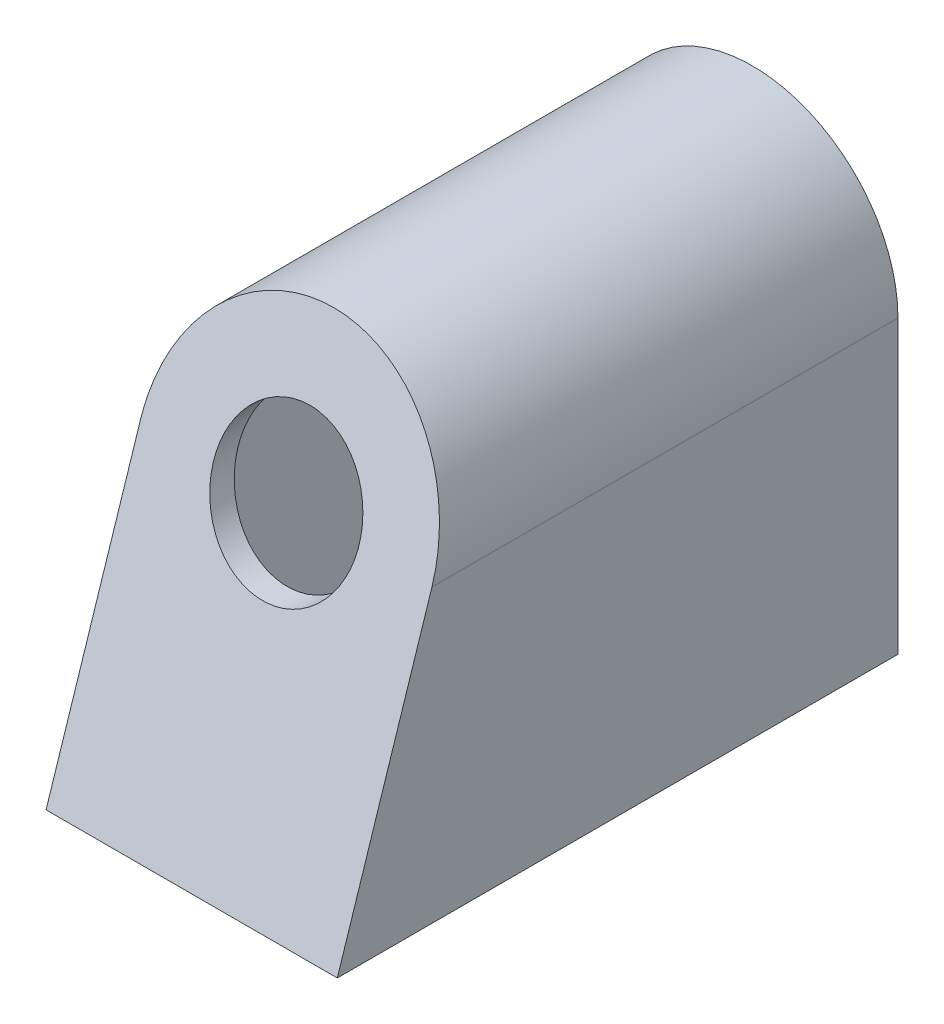
ISO-10303-21;
HEADER;
FILE_DESCRIPTION(('STEP AP214'),'2;1');
FILE_NAME('part.step','',(''),(''),'','','');
FILE_SCHEMA(('AUTOMOTIVE_DESIGN { 1 0 10303 214 1 1 1 1 }'));
ENDSEC;
DATA;
#1=APPLICATION_CONTEXT('core data for automotive mechanical design processes');
#2=APPLICATION_PROTOCOL_DEFINITION('international standard','automotive_design',2000,#1);
#3=PRODUCT_CONTEXT('',#1,'mechanical');
#4=PRODUCT('Part','Part','',(#3));
#5=PRODUCT_RELATED_PRODUCT_CATEGORY('part','',(#4));
#6=PRODUCT_DEFINITION_FORMATION('','',#4);
#7=PRODUCT_DEFINITION_CONTEXT('part definition',#1,'design');
#8=PRODUCT_DEFINITION('design','',#6,#7);
#9=PRODUCT_DEFINITION_SHAPE('','',#8);
#10=(LENGTH_UNIT() NAMED_UNIT(*) SI_UNIT(.MILLI.,.METRE.));
#11=(NAMED_UNIT(*) PLANE_ANGLE_UNIT() SI_UNIT($,.RADIAN.));
#12=(NAMED_UNIT(*) SI_UNIT($,.STERADIAN.) SOLID_ANGLE_UNIT());
#13=UNCERTAINTY_MEASURE_WITH_UNIT(LENGTH_MEASURE(1.E-05),#10,'distance_accuracy_value','');
#14=(GEOMETRIC_REPRESENTATION_CONTEXT(3) GLOBAL_UNCERTAINTY_ASSIGNED_CONTEXT((#13)) GLOBAL_UNIT_ASSIGNED_CONTEXT((#10,
#11,#12)) REPRESENTATION_CONTEXT('',''));
#15=CARTESIAN_POINT('',(0.,0.,0.));
#16=DIRECTION('',(0.,0.,1.));
#17=DIRECTION('',(1.,0.,0.));
#18=AXIS2_PLACEMENT_3D('',#15,#16,#17);
#19=CARTESIAN_POINT('',(0.,0.,96.5196491925174));
#20=DIRECTION('',(0.,0.,-1.));
#21=DIRECTION('',(-1.,0.,0.));
#22=AXIS2_PLACEMENT_3D('',#19,#20,#21);
#23=CYLINDRICAL_SURFACE('',#22,12.5);
#24=CARTESIAN_POINT('',(0.,0.,-4.20584889695308));
#25=DIRECTION('',(0.,0.309016994374948,0.951056516295154));
#26=DIRECTION('',(0.,0.951056516295153,-0.309016994374948));
#27=AXIS2_PLACEMENT_3D('',#24,#25,#26);
#28=ELLIPSE('',#27,13.1432778029783,12.5);
#29=CARTESIAN_POINT('',(0.,12.5,-8.26734509986442));
#30=VERTEX_POINT('',#29);
#31=EDGE_CURVE('E53',#30,#30,#28,.T.);
#32=ORIENTED_EDGE('',*,*,#31,.F.);
#33=EDGE_LOOP('',(#32));
#34=FACE_BOUND('',#33,.T.);
#35=CARTESIAN_POINT('',(0.,0.,0.));
#36=DIRECTION('',(0.,0.309016994374948,0.951056516295154));
#37=DIRECTION('',(0.,0.951056516295153,-0.309016994374948));
#38=AXIS2_PLACEMENT_3D('',#35,#36,#37);
#39=ELLIPSE('',#38,13.1432778029783,12.5);
#40=CARTESIAN_POINT('',(0.,12.5,-4.06149620291134));
#41=VERTEX_POINT('',#40);
#42=EDGE_CURVE('E157',#41,#41,#39,.T.);
#43=ORIENTED_EDGE('',*,*,#42,.T.);
#44=EDGE_LOOP('',(#43));
#45=FACE_BOUND('',#44,.T.);
#46=ADVANCED_FACE('F49',(#34,#45),#23,.F.);
#47=CARTESIAN_POINT('',(25.,0.,96.5196491925174));
#48=DIRECTION('',(1.,0.,0.));
#49=DIRECTION('',(0.,1.,0.));
#50=AXIS2_PLACEMENT_3D('',#47,#48,#49);
#51=PLANE('',#50);
#52=DIRECTION('',(0.,0.,-1.));
#53=VECTOR('',#52,1.);
#54=CARTESIAN_POINT('',(25.,0.,96.5196491925174));
#55=LINE('',#54,#53);
#56=CARTESIAN_POINT('',(25.,0.,0.));
#57=VERTEX_POINT('',#56);
#58=CARTESIAN_POINT('',(25.,0.,-80.));
#59=VERTEX_POINT('',#58);
#60=EDGE_CURVE('E177',#57,#59,#55,.T.);
#61=ORIENTED_EDGE('',*,*,#60,.F.);
#62=DIRECTION('',(0.,-0.951056516295153,0.309016994374948));
#63=VECTOR('',#62,1.);
#64=CARTESIAN_POINT('',(25.,-28.3664131759025,9.21680635233137));
#65=LINE('',#64,#63);
#66=CARTESIAN_POINT('',(25.,-50.,16.2459848116454));
#67=VERTEX_POINT('',#66);
#68=EDGE_CURVE('E154',#57,#67,#65,.T.);
#69=ORIENTED_EDGE('',*,*,#68,.T.);
#70=DIRECTION('',(0.,0.,-1.));
#71=VECTOR('',#70,1.);
#72=CARTESIAN_POINT('',(25.,-50.,96.5196491925174));
#73=LINE('',#72,#71);
#74=CARTESIAN_POINT('',(25.,-50.,-80.));
#75=VERTEX_POINT('',#74);
#76=EDGE_CURVE('E180',#67,#75,#73,.T.);
#77=ORIENTED_EDGE('',*,*,#76,.T.);
#78=DIRECTION('',(0.,-1.,0.));
#79=VECTOR('',#78,1.);
#80=CARTESIAN_POINT('',(25.,0.,-80.));
#81=LINE('',#80,#79);
#82=EDGE_CURVE('E170',#59,#75,#81,.T.);
#83=ORIENTED_EDGE('',*,*,#82,.F.);
#84=EDGE_LOOP('',(#61,#69,#77,#83));
#85=FACE_BOUND('',#84,.T.);
#86=ADVANCED_FACE('F210',(#85),#51,.T.);
#87=CARTESIAN_POINT('',(-25.,-50.,96.5196491925174));
#88=DIRECTION('',(0.,1.,0.));
#89=DIRECTION('',(0.,0.,1.));
#90=AXIS2_PLACEMENT_3D('',#87,#88,#89);
#91=PLANE('',#90);
#92=DIRECTION('',(1.,0.,0.));
#93=VECTOR('',#92,1.);
#94=CARTESIAN_POINT('',(-25.,-50.,16.2459848116454));
#95=LINE('',#94,#93);
#96=CARTESIAN_POINT('',(-25.,-50.,16.2459848116454));
#97=VERTEX_POINT('',#96);
#98=EDGE_CURVE('E66',#97,#67,#95,.T.);
#99=ORIENTED_EDGE('',*,*,#98,.F.);
#100=DIRECTION('',(0.,0.,-1.));
#101=VECTOR('',#100,1.);
#102=CARTESIAN_POINT('',(-25.,-50.,96.5196491925174));
#103=LINE('',#102,#101);
#104=CARTESIAN_POINT('',(-25.,-50.,-80.));
#105=VERTEX_POINT('',#104);
#106=EDGE_CURVE('E58',#97,#105,#103,.T.);
#107=ORIENTED_EDGE('',*,*,#106,.T.);
#108=DIRECTION('',(1.,0.,0.));
#109=VECTOR('',#108,1.);
#110=CARTESIAN_POINT('',(-25.,-50.,-80.));
#111=LINE('',#110,#109);
#112=EDGE_CURVE('E173',#105,#75,#111,.T.);
#113=ORIENTED_EDGE('',*,*,#112,.T.);
#114=ORIENTED_EDGE('',*,*,#76,.F.);
#115=EDGE_LOOP('',(#99,#107,#113,#114));
#116=FACE_BOUND('',#115,.T.);
#117=ADVANCED_FACE('F217',(#116),#91,.F.);
#118=CARTESIAN_POINT('',(-25.,0.,96.5196491925174));
#119=DIRECTION('',(1.,0.,0.));
#120=DIRECTION('',(0.,1.,0.));
#121=AXIS2_PLACEMENT_3D('',#118,#119,#120);
#122=PLANE('',#121);
#123=DIRECTION('',(0.,-0.951056516295153,0.309016994374948));
#124=VECTOR('',#123,1.);
#125=CARTESIAN_POINT('',(-25.,-28.3664131759025,9.21680635233137));
#126=LINE('',#125,#124);
#127=CARTESIAN_POINT('',(-25.,0.,0.));
#128=VERTEX_POINT('',#127);
#129=EDGE_CURVE('E159',#128,#97,#126,.T.);
#130=ORIENTED_EDGE('',*,*,#129,.F.);
#131=DIRECTION('',(0.,0.,-1.));
#132=VECTOR('',#131,1.);
#133=CARTESIAN_POINT('',(-25.,0.,96.5196491925174));
#134=LINE('',#133,#132);
#135=CARTESIAN_POINT('',(-25.,0.,-80.));
#136=VERTEX_POINT('',#135);
#137=EDGE_CURVE('E13',#128,#136,#134,.T.);
#138=ORIENTED_EDGE('',*,*,#137,.T.);
#139=DIRECTION('',(0.,-1.,0.));
#140=VECTOR('',#139,1.);
#141=CARTESIAN_POINT('',(-25.,0.,-80.));
#142=LINE('',#141,#140);
#143=EDGE_CURVE('E176',#136,#105,#142,.T.);
#144=ORIENTED_EDGE('',*,*,#143,.T.);
#145=ORIENTED_EDGE('',*,*,#106,.F.);
#146=EDGE_LOOP('',(#130,#138,#144,#145));
#147=FACE_BOUND('',#146,.T.);
#148=ADVANCED_FACE('F238',(#147),#122,.F.);
#149=CARTESIAN_POINT('',(0.,0.,96.5196491925174));
#150=DIRECTION('',(0.,0.,-1.));
#151=DIRECTION('',(-1.,0.,0.));
#152=AXIS2_PLACEMENT_3D('',#149,#150,#151);
#153=CYLINDRICAL_SURFACE('',#152,25.);
#154=ORIENTED_EDGE('',*,*,#137,.F.);
#155=CARTESIAN_POINT('',(0.,0.,0.));
#156=DIRECTION('',(0.,0.309016994374948,0.951056516295154));
#157=DIRECTION('',(0.,0.951056516295153,-0.309016994374948));
#158=AXIS2_PLACEMENT_3D('',#155,#156,#157);
#159=ELLIPSE('',#158,26.2865556059567,25.);
#160=EDGE_CURVE('E161',#128,#57,#159,.F.);
#161=ORIENTED_EDGE('',*,*,#160,.T.);
#162=ORIENTED_EDGE('',*,*,#60,.T.);
#163=CARTESIAN_POINT('',(0.,0.,-80.));
#164=DIRECTION('',(0.,0.,-1.));
#165=DIRECTION('',(-1.,0.,0.));
#166=AXIS2_PLACEMENT_3D('',#163,#164,#165);
#167=CIRCLE('',#166,25.);
#168=EDGE_CURVE('E167',#136,#59,#167,.T.);
#169=ORIENTED_EDGE('',*,*,#168,.F.);
#170=EDGE_LOOP('',(#154,#161,#162,#169));
#171=FACE_BOUND('',#170,.T.);
#172=ADVANCED_FACE('F51',(#171),#153,.T.);
#173=CARTESIAN_POINT('',(0.,0.,-80.));
#174=DIRECTION('',(0.,0.,-1.));
#175=DIRECTION('',(-1.,0.,0.));
#176=AXIS2_PLACEMENT_3D('',#173,#174,#175);
#177=PLANE('',#176);
#178=ORIENTED_EDGE('',*,*,#168,.T.);
#179=ORIENTED_EDGE('',*,*,#82,.T.);
#180=ORIENTED_EDGE('',*,*,#112,.F.);
#181=ORIENTED_EDGE('',*,*,#143,.F.);
#182=EDGE_LOOP('',(#178,#179,#180,#181));
#183=FACE_BOUND('',#182,.T.);
#184=CARTESIAN_POINT('',(0.,0.,-80.));
#185=DIRECTION('',(0.,0.,1.));
#186=DIRECTION('',(1.,0.,0.));
#187=AXIS2_PLACEMENT_3D('',#184,#185,#186);
#188=CIRCLE('',#187,12.5);
#189=CARTESIAN_POINT('',(12.5,0.,-80.));
#190=VERTEX_POINT('',#189);
#191=EDGE_CURVE('E164',#190,#190,#188,.T.);
#192=ORIENTED_EDGE('',*,*,#191,.T.);
#193=EDGE_LOOP('',(#192));
#194=FACE_BOUND('',#193,.T.);
#195=ADVANCED_FACE('F225',(#183,#194),#177,.T.);
#196=CARTESIAN_POINT('',(0.,0.,-60.));
#197=DIRECTION('',(0.,0.,-1.));
#198=DIRECTION('',(-1.,0.,0.));
#199=AXIS2_PLACEMENT_3D('',#196,#197,#198);
#200=CIRCLE('',#199,12.5);
#201=CARTESIAN_POINT('',(-12.5,0.,-60.));
#202=VERTEX_POINT('',#201);
#203=EDGE_CURVE('E184',#202,#202,#200,.T.);
#204=ORIENTED_EDGE('',*,*,#203,.F.);
#205=EDGE_LOOP('',(#204));
#206=FACE_BOUND('',#205,.T.);
#207=ORIENTED_EDGE('',*,*,#191,.F.);
#208=EDGE_LOOP('',(#207));
#209=FACE_BOUND('',#208,.T.);
#210=ADVANCED_FACE('F213',(#206,#209),#23,.F.);
#211=CARTESIAN_POINT('',(0.,0.,0.));
#212=DIRECTION('',(0.,0.309016994374948,0.951056516295154));
#213=DIRECTION('',(0.,-0.951056516295153,0.309016994374948));
#214=AXIS2_PLACEMENT_3D('',#211,#212,#213);
#215=PLANE('',#214);
#216=ORIENTED_EDGE('',*,*,#160,.F.);
#217=ORIENTED_EDGE('',*,*,#129,.T.);
#218=ORIENTED_EDGE('',*,*,#98,.T.);
#219=ORIENTED_EDGE('',*,*,#68,.F.);
#220=EDGE_LOOP('',(#216,#217,#218,#219));
#221=FACE_BOUND('',#220,.T.);
#222=ORIENTED_EDGE('',*,*,#42,.F.);
#223=EDGE_LOOP('',(#222));
#224=FACE_BOUND('',#223,.T.);
#225=ADVANCED_FACE('F224',(#221,#224),#215,.T.);
#226=CARTESIAN_POINT('',(0.,-1.23606797749979,-3.80422606518061));
#227=DIRECTION('',(0.,0.309016994374948,0.951056516295154));
#228=DIRECTION('',(0.,-0.951056516295153,0.309016994374948));
#229=AXIS2_PLACEMENT_3D('',#226,#227,#228);
#230=PLANE('',#229);
#231=ORIENTED_EDGE('',*,*,#31,.T.);
#232=EDGE_LOOP('',(#231));
#233=FACE_BOUND('',#232,.T.);
#234=CARTESIAN_POINT('',(0.,0.,-4.20584889695308));
#235=DIRECTION('',(0.,0.309016994374948,0.951056516295154));
#236=DIRECTION('',(0.,0.951056516295153,-0.309016994374948));
#237=AXIS2_PLACEMENT_3D('',#234,#235,#236);
#238=ELLIPSE('',#237,22.0807067090036,21.);
#239=CARTESIAN_POINT('',(-21.,0.,-4.20584889695308));
#240=VERTEX_POINT('',#239);
#241=CARTESIAN_POINT('',(21.,0.,-4.20584889695308));
#242=VERTEX_POINT('',#241);
#243=EDGE_CURVE('E130',#240,#242,#238,.F.);
#244=ORIENTED_EDGE('',*,*,#243,.T.);
#245=DIRECTION('',(0.,-0.951056516295153,0.309016994374948));
#246=VECTOR('',#245,1.);
#247=CARTESIAN_POINT('',(21.,-26.2070286073483,4.30933087731365));
#248=LINE('',#247,#246);
#249=CARTESIAN_POINT('',(21.,-46.,10.7404571297606));
#250=VERTEX_POINT('',#249);
#251=EDGE_CURVE('E116',#242,#250,#248,.T.);
#252=ORIENTED_EDGE('',*,*,#251,.T.);
#253=DIRECTION('',(1.,0.,0.));
#254=VECTOR('',#253,1.);
#255=CARTESIAN_POINT('',(-21.,-46.,10.7404571297607));
#256=LINE('',#255,#254);
#257=CARTESIAN_POINT('',(-21.,-46.,10.7404571297607));
#258=VERTEX_POINT('',#257);
#259=EDGE_CURVE('E146',#258,#250,#256,.T.);
#260=ORIENTED_EDGE('',*,*,#259,.F.);
#261=DIRECTION('',(0.,-0.951056516295153,0.309016994374948));
#262=VECTOR('',#261,1.);
#263=CARTESIAN_POINT('',(-21.,-26.2070286073483,4.30933087731365));
#264=LINE('',#263,#262);
#265=EDGE_CURVE('E136',#240,#258,#264,.T.);
#266=ORIENTED_EDGE('',*,*,#265,.F.);
#267=EDGE_LOOP('',(#244,#252,#260,#266));
#268=FACE_BOUND('',#267,.T.);
#269=ADVANCED_FACE('F135',(#233,#268),#230,.F.);
#270=CARTESIAN_POINT('',(0.,0.,-60.));
#271=DIRECTION('',(0.,0.,-1.));
#272=DIRECTION('',(-1.,0.,0.));
#273=AXIS2_PLACEMENT_3D('',#270,#271,#272);
#274=PLANE('',#273);
#275=ORIENTED_EDGE('',*,*,#203,.T.);
#276=EDGE_LOOP('',(#275));
#277=FACE_BOUND('',#276,.T.);
#278=DIRECTION('',(0.,-1.,0.));
#279=VECTOR('',#278,1.);
#280=CARTESIAN_POINT('',(-21.,0.,-60.));
#281=LINE('',#280,#279);
#282=CARTESIAN_POINT('',(-21.,0.,-60.));
#283=VERTEX_POINT('',#282);
#284=CARTESIAN_POINT('',(-21.,-46.,-60.));
#285=VERTEX_POINT('',#284);
#286=EDGE_CURVE('E143',#283,#285,#281,.T.);
#287=ORIENTED_EDGE('',*,*,#286,.T.);
#288=DIRECTION('',(1.,0.,0.));
#289=VECTOR('',#288,1.);
#290=CARTESIAN_POINT('',(-21.,-46.,-60.));
#291=LINE('',#290,#289);
#292=CARTESIAN_POINT('',(21.,-46.,-60.));
#293=VERTEX_POINT('',#292);
#294=EDGE_CURVE('E150',#285,#293,#291,.T.);
#295=ORIENTED_EDGE('',*,*,#294,.T.);
#296=DIRECTION('',(0.,-1.,0.));
#297=VECTOR('',#296,1.);
#298=CARTESIAN_POINT('',(21.,0.,-60.));
#299=LINE('',#298,#297);
#300=CARTESIAN_POINT('',(21.,0.,-60.));
#301=VERTEX_POINT('',#300);
#302=EDGE_CURVE('E138',#301,#293,#299,.T.);
#303=ORIENTED_EDGE('',*,*,#302,.F.);
#304=CARTESIAN_POINT('',(0.,0.,-60.));
#305=DIRECTION('',(0.,0.,-1.));
#306=DIRECTION('',(-1.,0.,0.));
#307=AXIS2_PLACEMENT_3D('',#304,#305,#306);
#308=CIRCLE('',#307,21.);
#309=EDGE_CURVE('E133',#283,#301,#308,.T.);
#310=ORIENTED_EDGE('',*,*,#309,.F.);
#311=EDGE_LOOP('',(#287,#295,#303,#310));
#312=FACE_BOUND('',#311,.T.);
#313=ADVANCED_FACE('F193',(#277,#312),#274,.F.);
#314=CARTESIAN_POINT('',(0.,0.,84.9662713804304));
#315=DIRECTION('',(0.,0.,-1.));
#316=DIRECTION('',(-1.,0.,0.));
#317=AXIS2_PLACEMENT_3D('',#314,#315,#316);
#318=CYLINDRICAL_SURFACE('',#317,21.);
#319=DIRECTION('',(0.,0.,-1.));
#320=VECTOR('',#319,1.);
#321=CARTESIAN_POINT('',(-21.,0.,84.9662713804304));
#322=LINE('',#321,#320);
#323=EDGE_CURVE('E152',#240,#283,#322,.T.);
#324=ORIENTED_EDGE('',*,*,#323,.T.);
#325=ORIENTED_EDGE('',*,*,#309,.T.);
#326=DIRECTION('',(0.,0.,-1.));
#327=VECTOR('',#326,1.);
#328=CARTESIAN_POINT('',(21.,0.,84.9662713804304));
#329=LINE('',#328,#327);
#330=EDGE_CURVE('E120',#242,#301,#329,.T.);
#331=ORIENTED_EDGE('',*,*,#330,.F.);
#332=ORIENTED_EDGE('',*,*,#243,.F.);
#333=EDGE_LOOP('',(#324,#325,#331,#332));
#334=FACE_BOUND('',#333,.T.);
#335=ADVANCED_FACE('F129',(#334),#318,.F.);
#336=CARTESIAN_POINT('',(21.,0.,84.9662713804304));
#337=DIRECTION('',(1.,0.,0.));
#338=DIRECTION('',(0.,1.,0.));
#339=AXIS2_PLACEMENT_3D('',#336,#337,#338);
#340=PLANE('',#339);
#341=ORIENTED_EDGE('',*,*,#330,.T.);
#342=ORIENTED_EDGE('',*,*,#302,.T.);
#343=DIRECTION('',(0.,0.,-1.));
#344=VECTOR('',#343,1.);
#345=CARTESIAN_POINT('',(21.,-46.,84.9662713804304));
#346=LINE('',#345,#344);
#347=EDGE_CURVE('E122',#250,#293,#346,.T.);
#348=ORIENTED_EDGE('',*,*,#347,.F.);
#349=ORIENTED_EDGE('',*,*,#251,.F.);
#350=EDGE_LOOP('',(#341,#342,#348,#349));
#351=FACE_BOUND('',#350,.T.);
#352=ADVANCED_FACE('F118',(#351),#340,.F.);
#353=CARTESIAN_POINT('',(-21.,-46.,84.9662713804304));
#354=DIRECTION('',(0.,1.,0.));
#355=DIRECTION('',(0.,0.,1.));
#356=AXIS2_PLACEMENT_3D('',#353,#354,#355);
#357=PLANE('',#356);
#358=ORIENTED_EDGE('',*,*,#259,.T.);
#359=ORIENTED_EDGE('',*,*,#347,.T.);
#360=ORIENTED_EDGE('',*,*,#294,.F.);
#361=DIRECTION('',(0.,0.,-1.));
#362=VECTOR('',#361,1.);
#363=CARTESIAN_POINT('',(-21.,-46.,84.9662713804304));
#364=LINE('',#363,#362);
#365=EDGE_CURVE('E148',#258,#285,#364,.T.);
#366=ORIENTED_EDGE('',*,*,#365,.F.);
#367=EDGE_LOOP('',(#358,#359,#360,#366));
#368=FACE_BOUND('',#367,.T.);
#369=ADVANCED_FACE('F199',(#368),#357,.T.);
#370=CARTESIAN_POINT('',(-21.,0.,84.9662713804304));
#371=DIRECTION('',(1.,0.,0.));
#372=DIRECTION('',(0.,0.,-1.));
#373=AXIS2_PLACEMENT_3D('',#370,#371,#372);
#374=PLANE('',#373);
#375=ORIENTED_EDGE('',*,*,#265,.T.);
#376=ORIENTED_EDGE('',*,*,#365,.T.);
#377=ORIENTED_EDGE('',*,*,#286,.F.);
#378=ORIENTED_EDGE('',*,*,#323,.F.);
#379=EDGE_LOOP('',(#375,#376,#377,#378));
#380=FACE_BOUND('',#379,.T.);
#381=ADVANCED_FACE('F196',(#380),#374,.T.);
#382=CLOSED_SHELL('',(#46,#86,#117,#148,#172,#195,#210,#225,#269,#313,#335,#352,#369,#381));
#383=MANIFOLD_SOLID_BREP('B2',#382);
#384=ADVANCED_BREP_SHAPE_REPRESENTATION('',(#18,#383),#14);
#385=SHAPE_DEFINITION_REPRESENTATION(#9,#384);
ENDSEC;
END-ISO-10303-21;
